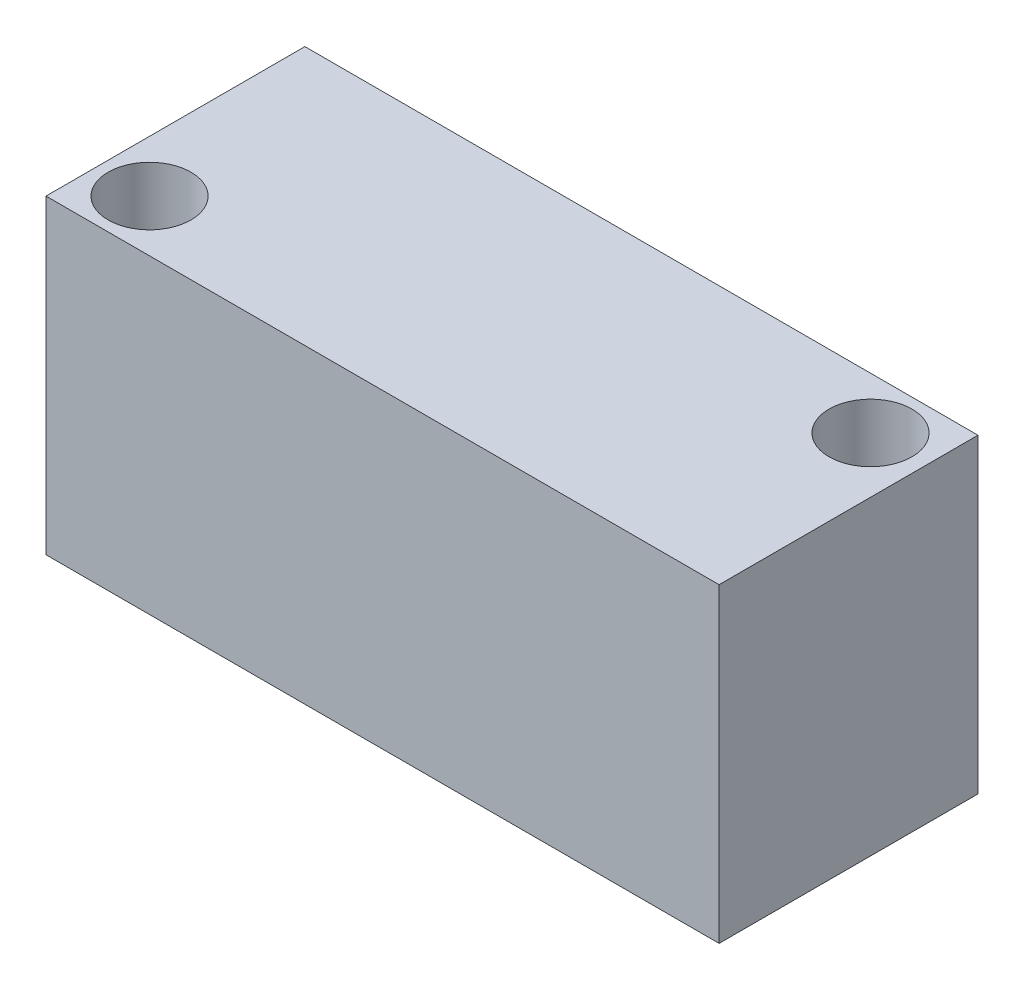
ISO-10303-21;
HEADER;
FILE_DESCRIPTION(('STEP AP214'),'2;1');
FILE_NAME('part.step','',(''),(''),'','','');
FILE_SCHEMA(('AUTOMOTIVE_DESIGN { 1 0 10303 214 1 1 1 1 }'));
ENDSEC;
DATA;
#1=APPLICATION_CONTEXT('core data for automotive mechanical design processes');
#2=APPLICATION_PROTOCOL_DEFINITION('international standard','automotive_design',2000,#1);
#3=PRODUCT_CONTEXT('',#1,'mechanical');
#4=PRODUCT('Part','Part','',(#3));
#5=PRODUCT_RELATED_PRODUCT_CATEGORY('part','',(#4));
#6=PRODUCT_DEFINITION_FORMATION('','',#4);
#7=PRODUCT_DEFINITION_CONTEXT('part definition',#1,'design');
#8=PRODUCT_DEFINITION('design','',#6,#7);
#9=PRODUCT_DEFINITION_SHAPE('','',#8);
#10=(LENGTH_UNIT() NAMED_UNIT(*) SI_UNIT(.MILLI.,.METRE.));
#11=(NAMED_UNIT(*) PLANE_ANGLE_UNIT() SI_UNIT($,.RADIAN.));
#12=(NAMED_UNIT(*) SI_UNIT($,.STERADIAN.) SOLID_ANGLE_UNIT());
#13=UNCERTAINTY_MEASURE_WITH_UNIT(LENGTH_MEASURE(1.E-05),#10,'distance_accuracy_value','');
#14=(GEOMETRIC_REPRESENTATION_CONTEXT(3) GLOBAL_UNCERTAINTY_ASSIGNED_CONTEXT((#13)) GLOBAL_UNIT_ASSIGNED_CONTEXT((#10,
#11,#12)) REPRESENTATION_CONTEXT('',''));
#15=CARTESIAN_POINT('',(0.,0.,0.));
#16=DIRECTION('',(0.,0.,1.));
#17=DIRECTION('',(1.,0.,0.));
#18=AXIS2_PLACEMENT_3D('',#15,#16,#17);
#19=CARTESIAN_POINT('',(0.,30.,0.));
#20=DIRECTION('',(0.,1.,0.));
#21=DIRECTION('',(0.,0.,1.));
#22=AXIS2_PLACEMENT_3D('',#19,#20,#21);
#23=PLANE('',#22);
#24=CARTESIAN_POINT('',(37.3146086743814,30.,18.686863063016));
#25=DIRECTION('',(0.,1.,0.));
#26=DIRECTION('',(0.,0.,1.));
#27=AXIS2_PLACEMENT_3D('',#24,#25,#26);
#28=CIRCLE('',#27,4.);
#29=CARTESIAN_POINT('',(37.3146086743814,30.,22.686863063016));
#30=VERTEX_POINT('',#29);
#31=EDGE_CURVE('E100',#30,#30,#28,.T.);
#32=ORIENTED_EDGE('',*,*,#31,.F.);
#33=EDGE_LOOP('',(#32));
#34=FACE_BOUND('',#33,.T.);
#35=DIRECTION('',(0.,0.,-1.));
#36=VECTOR('',#35,1.);
#37=CARTESIAN_POINT('',(97.3146086743813,30.,-1.313136936984));
#38=LINE('',#37,#36);
#39=CARTESIAN_POINT('',(97.3146086743813,30.,23.686863063016));
#40=VERTEX_POINT('',#39);
#41=CARTESIAN_POINT('',(97.3146086743813,30.,-1.313136936984));
#42=VERTEX_POINT('',#41);
#43=EDGE_CURVE('E85',#40,#42,#38,.T.);
#44=ORIENTED_EDGE('',*,*,#43,.T.);
#45=DIRECTION('',(-1.,0.,0.));
#46=VECTOR('',#45,1.);
#47=CARTESIAN_POINT('',(32.3146086743814,30.,-1.313136936984));
#48=LINE('',#47,#46);
#49=CARTESIAN_POINT('',(32.3146086743814,30.,-1.313136936984));
#50=VERTEX_POINT('',#49);
#51=EDGE_CURVE('E80',#42,#50,#48,.T.);
#52=ORIENTED_EDGE('',*,*,#51,.T.);
#53=DIRECTION('',(0.,0.,1.));
#54=VECTOR('',#53,1.);
#55=CARTESIAN_POINT('',(32.3146086743814,30.,-1.313136936984));
#56=LINE('',#55,#54);
#57=CARTESIAN_POINT('',(32.3146086743814,30.,23.686863063016));
#58=VERTEX_POINT('',#57);
#59=EDGE_CURVE('E83',#50,#58,#56,.T.);
#60=ORIENTED_EDGE('',*,*,#59,.T.);
#61=DIRECTION('',(1.,0.,0.));
#62=VECTOR('',#61,1.);
#63=CARTESIAN_POINT('',(32.3146086743814,30.,23.686863063016));
#64=LINE('',#63,#62);
#65=EDGE_CURVE('E50',#58,#40,#64,.T.);
#66=ORIENTED_EDGE('',*,*,#65,.T.);
#67=EDGE_LOOP('',(#44,#52,#60,#66));
#68=FACE_BOUND('',#67,.T.);
#69=CARTESIAN_POINT('',(91.9343501970213,30.,3.686863063016));
#70=DIRECTION('',(0.,1.,0.));
#71=DIRECTION('',(0.,0.,1.));
#72=AXIS2_PLACEMENT_3D('',#69,#70,#71);
#73=CIRCLE('',#72,4.00000000000001);
#74=CARTESIAN_POINT('',(91.9343501970213,30.,7.68686306301601));
#75=VERTEX_POINT('',#74);
#76=EDGE_CURVE('E115',#75,#75,#73,.T.);
#77=ORIENTED_EDGE('',*,*,#76,.F.);
#78=EDGE_LOOP('',(#77));
#79=FACE_BOUND('',#78,.T.);
#80=ADVANCED_FACE('F33',(#34,#68,#79),#23,.T.);
#81=CARTESIAN_POINT('',(0.,0.,0.));
#82=DIRECTION('',(0.,1.,0.));
#83=DIRECTION('',(0.,0.,1.));
#84=AXIS2_PLACEMENT_3D('',#81,#82,#83);
#85=PLANE('',#84);
#86=DIRECTION('',(0.,0.,-1.));
#87=VECTOR('',#86,1.);
#88=CARTESIAN_POINT('',(97.3146086743813,0.,-1.313136936984));
#89=LINE('',#88,#87);
#90=CARTESIAN_POINT('',(97.3146086743813,0.,23.686863063016));
#91=VERTEX_POINT('',#90);
#92=CARTESIAN_POINT('',(97.3146086743813,0.,-1.313136936984));
#93=VERTEX_POINT('',#92);
#94=EDGE_CURVE('E97',#91,#93,#89,.T.);
#95=ORIENTED_EDGE('',*,*,#94,.F.);
#96=DIRECTION('',(1.,0.,0.));
#97=VECTOR('',#96,1.);
#98=CARTESIAN_POINT('',(32.3146086743814,0.,23.686863063016));
#99=LINE('',#98,#97);
#100=CARTESIAN_POINT('',(32.3146086743814,0.,23.686863063016));
#101=VERTEX_POINT('',#100);
#102=EDGE_CURVE('E73',#101,#91,#99,.T.);
#103=ORIENTED_EDGE('',*,*,#102,.F.);
#104=DIRECTION('',(0.,0.,1.));
#105=VECTOR('',#104,1.);
#106=CARTESIAN_POINT('',(32.3146086743814,0.,-1.313136936984));
#107=LINE('',#106,#105);
#108=CARTESIAN_POINT('',(32.3146086743814,0.,-1.313136936984));
#109=VERTEX_POINT('',#108);
#110=EDGE_CURVE('E67',#109,#101,#107,.T.);
#111=ORIENTED_EDGE('',*,*,#110,.F.);
#112=DIRECTION('',(-1.,0.,0.));
#113=VECTOR('',#112,1.);
#114=CARTESIAN_POINT('',(32.3146086743814,0.,-1.313136936984));
#115=LINE('',#114,#113);
#116=EDGE_CURVE('E89',#93,#109,#115,.T.);
#117=ORIENTED_EDGE('',*,*,#116,.F.);
#118=EDGE_LOOP('',(#95,#103,#111,#117));
#119=FACE_BOUND('',#118,.T.);
#120=CARTESIAN_POINT('',(37.3146086743814,0.,18.686863063016));
#121=DIRECTION('',(0.,1.,0.));
#122=DIRECTION('',(0.,0.,1.));
#123=AXIS2_PLACEMENT_3D('',#120,#121,#122);
#124=CIRCLE('',#123,4.);
#125=CARTESIAN_POINT('',(37.3146086743814,0.,22.686863063016));
#126=VERTEX_POINT('',#125);
#127=EDGE_CURVE('E112',#126,#126,#124,.T.);
#128=ORIENTED_EDGE('',*,*,#127,.T.);
#129=EDGE_LOOP('',(#128));
#130=FACE_BOUND('',#129,.T.);
#131=CARTESIAN_POINT('',(91.9343501970213,0.,3.686863063016));
#132=DIRECTION('',(0.,1.,0.));
#133=DIRECTION('',(0.,0.,1.));
#134=AXIS2_PLACEMENT_3D('',#131,#132,#133);
#135=CIRCLE('',#134,4.00000000000001);
#136=CARTESIAN_POINT('',(91.9343501970213,0.,7.68686306301601));
#137=VERTEX_POINT('',#136);
#138=EDGE_CURVE('E118',#137,#137,#135,.T.);
#139=ORIENTED_EDGE('',*,*,#138,.T.);
#140=EDGE_LOOP('',(#139));
#141=FACE_BOUND('',#140,.T.);
#142=ADVANCED_FACE('F108',(#119,#130,#141),#85,.F.);
#143=CARTESIAN_POINT('',(97.3146086743813,30.,-1.313136936984));
#144=DIRECTION('',(-1.,0.,0.));
#145=DIRECTION('',(0.,0.,1.));
#146=AXIS2_PLACEMENT_3D('',#143,#144,#145);
#147=PLANE('',#146);
#148=ORIENTED_EDGE('',*,*,#94,.T.);
#149=DIRECTION('',(0.,-1.,0.));
#150=VECTOR('',#149,1.);
#151=CARTESIAN_POINT('',(97.3146086743813,30.,-1.313136936984));
#152=LINE('',#151,#150);
#153=EDGE_CURVE('E11',#42,#93,#152,.T.);
#154=ORIENTED_EDGE('',*,*,#153,.F.);
#155=ORIENTED_EDGE('',*,*,#43,.F.);
#156=DIRECTION('',(0.,-1.,0.));
#157=VECTOR('',#156,1.);
#158=CARTESIAN_POINT('',(97.3146086743813,30.,23.686863063016));
#159=LINE('',#158,#157);
#160=EDGE_CURVE('E93',#40,#91,#159,.T.);
#161=ORIENTED_EDGE('',*,*,#160,.T.);
#162=EDGE_LOOP('',(#148,#154,#155,#161));
#163=FACE_BOUND('',#162,.T.);
#164=ADVANCED_FACE('F35',(#163),#147,.F.);
#165=CARTESIAN_POINT('',(32.3146086743814,30.,-1.313136936984));
#166=DIRECTION('',(0.,0.,1.));
#167=DIRECTION('',(1.,0.,0.));
#168=AXIS2_PLACEMENT_3D('',#165,#166,#167);
#169=PLANE('',#168);
#170=ORIENTED_EDGE('',*,*,#116,.T.);
#171=DIRECTION('',(0.,-1.,0.));
#172=VECTOR('',#171,1.);
#173=CARTESIAN_POINT('',(32.3146086743814,30.,-1.313136936984));
#174=LINE('',#173,#172);
#175=EDGE_CURVE('E42',#50,#109,#174,.T.);
#176=ORIENTED_EDGE('',*,*,#175,.F.);
#177=ORIENTED_EDGE('',*,*,#51,.F.);
#178=ORIENTED_EDGE('',*,*,#153,.T.);
#179=EDGE_LOOP('',(#170,#176,#177,#178));
#180=FACE_BOUND('',#179,.T.);
#181=ADVANCED_FACE('F88',(#180),#169,.F.);
#182=CARTESIAN_POINT('',(32.3146086743814,30.,-1.313136936984));
#183=DIRECTION('',(1.,0.,0.));
#184=DIRECTION('',(0.,0.,-1.));
#185=AXIS2_PLACEMENT_3D('',#182,#183,#184);
#186=PLANE('',#185);
#187=ORIENTED_EDGE('',*,*,#110,.T.);
#188=DIRECTION('',(0.,-1.,0.));
#189=VECTOR('',#188,1.);
#190=CARTESIAN_POINT('',(32.3146086743814,30.,23.686863063016));
#191=LINE('',#190,#189);
#192=EDGE_CURVE('E90',#58,#101,#191,.T.);
#193=ORIENTED_EDGE('',*,*,#192,.F.);
#194=ORIENTED_EDGE('',*,*,#59,.F.);
#195=ORIENTED_EDGE('',*,*,#175,.T.);
#196=EDGE_LOOP('',(#187,#193,#194,#195));
#197=FACE_BOUND('',#196,.T.);
#198=ADVANCED_FACE('F91',(#197),#186,.F.);
#199=CARTESIAN_POINT('',(32.3146086743814,30.,23.686863063016));
#200=DIRECTION('',(0.,0.,-1.));
#201=DIRECTION('',(-1.,0.,0.));
#202=AXIS2_PLACEMENT_3D('',#199,#200,#201);
#203=PLANE('',#202);
#204=ORIENTED_EDGE('',*,*,#102,.T.);
#205=ORIENTED_EDGE('',*,*,#160,.F.);
#206=ORIENTED_EDGE('',*,*,#65,.F.);
#207=ORIENTED_EDGE('',*,*,#192,.T.);
#208=EDGE_LOOP('',(#204,#205,#206,#207));
#209=FACE_BOUND('',#208,.T.);
#210=ADVANCED_FACE('F105',(#209),#203,.F.);
#211=CARTESIAN_POINT('',(37.3146086743814,30.,18.686863063016));
#212=DIRECTION('',(0.,-1.,0.));
#213=DIRECTION('',(0.,0.,-1.));
#214=AXIS2_PLACEMENT_3D('',#211,#212,#213);
#215=CYLINDRICAL_SURFACE('',#214,4.);
#216=ORIENTED_EDGE('',*,*,#31,.T.);
#217=EDGE_LOOP('',(#216));
#218=FACE_BOUND('',#217,.T.);
#219=ORIENTED_EDGE('',*,*,#127,.F.);
#220=EDGE_LOOP('',(#219));
#221=FACE_BOUND('',#220,.T.);
#222=ADVANCED_FACE('F135',(#218,#221),#215,.F.);
#223=CARTESIAN_POINT('',(91.9343501970213,30.,3.686863063016));
#224=DIRECTION('',(0.,-1.,0.));
#225=DIRECTION('',(0.,0.,-1.));
#226=AXIS2_PLACEMENT_3D('',#223,#224,#225);
#227=CYLINDRICAL_SURFACE('',#226,4.00000000000001);
#228=ORIENTED_EDGE('',*,*,#76,.T.);
#229=EDGE_LOOP('',(#228));
#230=FACE_BOUND('',#229,.T.);
#231=ORIENTED_EDGE('',*,*,#138,.F.);
#232=EDGE_LOOP('',(#231));
#233=FACE_BOUND('',#232,.T.);
#234=ADVANCED_FACE('F124',(#230,#233),#227,.F.);
#235=CLOSED_SHELL('',(#80,#142,#164,#181,#198,#210,#222,#234));
#236=MANIFOLD_SOLID_BREP('B2',#235);
#237=ADVANCED_BREP_SHAPE_REPRESENTATION('',(#18,#236),#14);
#238=SHAPE_DEFINITION_REPRESENTATION(#9,#237);
ENDSEC;
END-ISO-10303-21;
